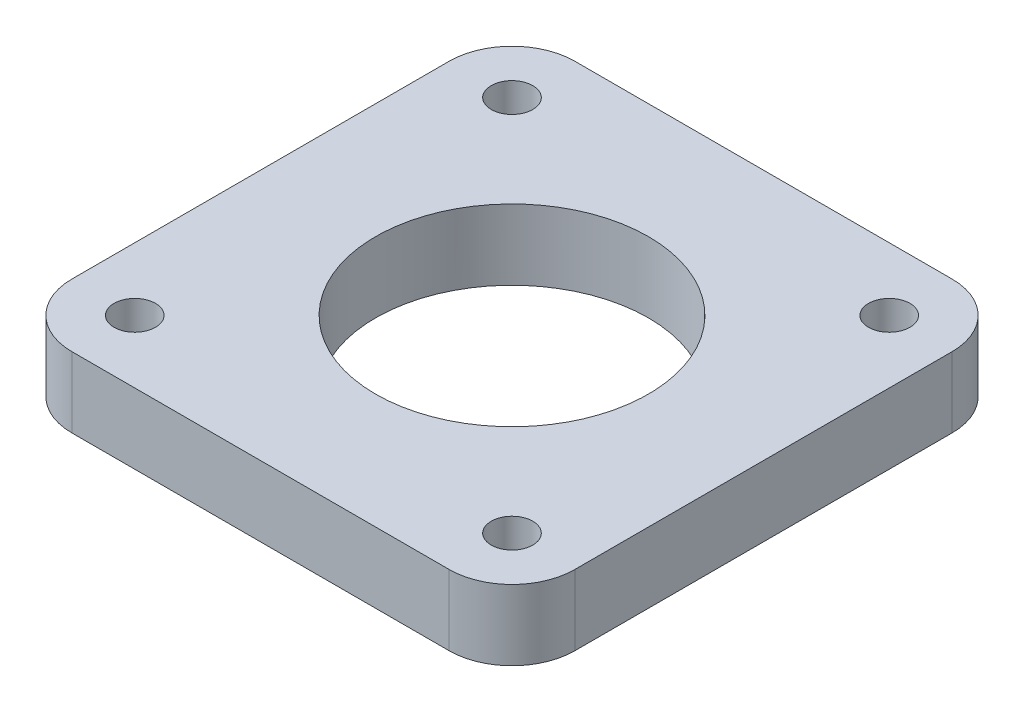
ISO-10303-21;
HEADER;
FILE_DESCRIPTION(('STEP AP214'),'2;1');
FILE_NAME('part.step','',(''),(''),'','','');
FILE_SCHEMA(('AUTOMOTIVE_DESIGN { 1 0 10303 214 1 1 1 1 }'));
ENDSEC;
DATA;
#1=APPLICATION_CONTEXT('core data for automotive mechanical design processes');
#2=APPLICATION_PROTOCOL_DEFINITION('international standard','automotive_design',2000,#1);
#3=PRODUCT_CONTEXT('',#1,'mechanical');
#4=PRODUCT('Part','Part','',(#3));
#5=PRODUCT_RELATED_PRODUCT_CATEGORY('part','',(#4));
#6=PRODUCT_DEFINITION_FORMATION('','',#4);
#7=PRODUCT_DEFINITION_CONTEXT('part definition',#1,'design');
#8=PRODUCT_DEFINITION('design','',#6,#7);
#9=PRODUCT_DEFINITION_SHAPE('','',#8);
#10=(LENGTH_UNIT() NAMED_UNIT(*) SI_UNIT(.MILLI.,.METRE.));
#11=(NAMED_UNIT(*) PLANE_ANGLE_UNIT() SI_UNIT($,.RADIAN.));
#12=(NAMED_UNIT(*) SI_UNIT($,.STERADIAN.) SOLID_ANGLE_UNIT());
#13=UNCERTAINTY_MEASURE_WITH_UNIT(LENGTH_MEASURE(1.E-05),#10,'distance_accuracy_value','');
#14=(GEOMETRIC_REPRESENTATION_CONTEXT(3) GLOBAL_UNCERTAINTY_ASSIGNED_CONTEXT((#13)) GLOBAL_UNIT_ASSIGNED_CONTEXT((#10,
#11,#12)) REPRESENTATION_CONTEXT('',''));
#15=CARTESIAN_POINT('',(0.,0.,0.));
#16=DIRECTION('',(0.,0.,1.));
#17=DIRECTION('',(1.,0.,0.));
#18=AXIS2_PLACEMENT_3D('',#15,#16,#17);
#19=CARTESIAN_POINT('',(15.,5.6,15.));
#20=DIRECTION('',(0.,-1.,0.));
#21=DIRECTION('',(0.,0.,-1.));
#22=AXIS2_PLACEMENT_3D('',#19,#20,#21);
#23=CYLINDRICAL_SURFACE('',#22,5.);
#24=CARTESIAN_POINT('',(15.,0.,15.));
#25=DIRECTION('',(0.,1.,0.));
#26=DIRECTION('',(0.,0.,1.));
#27=AXIS2_PLACEMENT_3D('',#24,#25,#26);
#28=CIRCLE('',#27,5.);
#29=CARTESIAN_POINT('',(15.,0.,20.));
#30=VERTEX_POINT('',#29);
#31=CARTESIAN_POINT('',(20.,0.,15.));
#32=VERTEX_POINT('',#31);
#33=EDGE_CURVE('E144',#30,#32,#28,.T.);
#34=ORIENTED_EDGE('',*,*,#33,.T.);
#35=DIRECTION('',(0.,-1.,0.));
#36=VECTOR('',#35,1.);
#37=CARTESIAN_POINT('',(20.,5.6,15.));
#38=LINE('',#37,#36);
#39=CARTESIAN_POINT('',(20.,5.6,15.));
#40=VERTEX_POINT('',#39);
#41=EDGE_CURVE('E11',#40,#32,#38,.T.);
#42=ORIENTED_EDGE('',*,*,#41,.F.);
#43=CARTESIAN_POINT('',(15.,5.6,15.));
#44=DIRECTION('',(0.,1.,0.));
#45=DIRECTION('',(0.,0.,1.));
#46=AXIS2_PLACEMENT_3D('',#43,#44,#45);
#47=CIRCLE('',#46,5.);
#48=CARTESIAN_POINT('',(15.,5.6,20.));
#49=VERTEX_POINT('',#48);
#50=EDGE_CURVE('E167',#49,#40,#47,.T.);
#51=ORIENTED_EDGE('',*,*,#50,.F.);
#52=DIRECTION('',(0.,-1.,0.));
#53=VECTOR('',#52,1.);
#54=CARTESIAN_POINT('',(15.,5.6,20.));
#55=LINE('',#54,#53);
#56=EDGE_CURVE('E140',#49,#30,#55,.T.);
#57=ORIENTED_EDGE('',*,*,#56,.T.);
#58=EDGE_LOOP('',(#34,#42,#51,#57));
#59=FACE_BOUND('',#58,.T.);
#60=ADVANCED_FACE('F43',(#59),#23,.T.);
#61=CARTESIAN_POINT('',(20.,5.6,-15.));
#62=DIRECTION('',(-1.,0.,0.));
#63=DIRECTION('',(0.,0.,1.));
#64=AXIS2_PLACEMENT_3D('',#61,#62,#63);
#65=PLANE('',#64);
#66=DIRECTION('',(0.,0.,-1.));
#67=VECTOR('',#66,1.);
#68=CARTESIAN_POINT('',(20.,0.,-15.));
#69=LINE('',#68,#67);
#70=CARTESIAN_POINT('',(20.,0.,-15.));
#71=VERTEX_POINT('',#70);
#72=EDGE_CURVE('E148',#32,#71,#69,.T.);
#73=ORIENTED_EDGE('',*,*,#72,.T.);
#74=DIRECTION('',(0.,-1.,0.));
#75=VECTOR('',#74,1.);
#76=CARTESIAN_POINT('',(20.,5.6,-15.));
#77=LINE('',#76,#75);
#78=CARTESIAN_POINT('',(20.,5.6,-15.));
#79=VERTEX_POINT('',#78);
#80=EDGE_CURVE('E52',#79,#71,#77,.T.);
#81=ORIENTED_EDGE('',*,*,#80,.F.);
#82=DIRECTION('',(0.,0.,-1.));
#83=VECTOR('',#82,1.);
#84=CARTESIAN_POINT('',(20.,5.6,-15.));
#85=LINE('',#84,#83);
#86=EDGE_CURVE('E103',#40,#79,#85,.T.);
#87=ORIENTED_EDGE('',*,*,#86,.F.);
#88=ORIENTED_EDGE('',*,*,#41,.T.);
#89=EDGE_LOOP('',(#73,#81,#87,#88));
#90=FACE_BOUND('',#89,.T.);
#91=ADVANCED_FACE('F277',(#90),#65,.F.);
#92=CARTESIAN_POINT('',(15.,5.6,-15.));
#93=DIRECTION('',(0.,-1.,0.));
#94=DIRECTION('',(0.,0.,-1.));
#95=AXIS2_PLACEMENT_3D('',#92,#93,#94);
#96=CYLINDRICAL_SURFACE('',#95,5.);
#97=CARTESIAN_POINT('',(15.,0.,-15.));
#98=DIRECTION('',(0.,1.,0.));
#99=DIRECTION('',(0.,0.,-1.));
#100=AXIS2_PLACEMENT_3D('',#97,#98,#99);
#101=CIRCLE('',#100,5.);
#102=CARTESIAN_POINT('',(15.,0.,-20.));
#103=VERTEX_POINT('',#102);
#104=EDGE_CURVE('E152',#71,#103,#101,.T.);
#105=ORIENTED_EDGE('',*,*,#104,.T.);
#106=DIRECTION('',(0.,-1.,0.));
#107=VECTOR('',#106,1.);
#108=CARTESIAN_POINT('',(15.,5.6,-20.));
#109=LINE('',#108,#107);
#110=CARTESIAN_POINT('',(15.,5.6,-20.));
#111=VERTEX_POINT('',#110);
#112=EDGE_CURVE('E178',#111,#103,#109,.T.);
#113=ORIENTED_EDGE('',*,*,#112,.F.);
#114=CARTESIAN_POINT('',(15.,5.6,-15.));
#115=DIRECTION('',(0.,1.,0.));
#116=DIRECTION('',(0.,0.,-1.));
#117=AXIS2_PLACEMENT_3D('',#114,#115,#116);
#118=CIRCLE('',#117,5.);
#119=EDGE_CURVE('E188',#79,#111,#118,.T.);
#120=ORIENTED_EDGE('',*,*,#119,.F.);
#121=ORIENTED_EDGE('',*,*,#80,.T.);
#122=EDGE_LOOP('',(#105,#113,#120,#121));
#123=FACE_BOUND('',#122,.T.);
#124=ADVANCED_FACE('F186',(#123),#96,.T.);
#125=CARTESIAN_POINT('',(-15.,5.6,-20.));
#126=DIRECTION('',(0.,0.,1.));
#127=DIRECTION('',(1.,0.,0.));
#128=AXIS2_PLACEMENT_3D('',#125,#126,#127);
#129=PLANE('',#128);
#130=DIRECTION('',(-1.,0.,0.));
#131=VECTOR('',#130,1.);
#132=CARTESIAN_POINT('',(-15.,0.,-20.));
#133=LINE('',#132,#131);
#134=CARTESIAN_POINT('',(-15.,0.,-20.));
#135=VERTEX_POINT('',#134);
#136=EDGE_CURVE('E155',#103,#135,#133,.T.);
#137=ORIENTED_EDGE('',*,*,#136,.T.);
#138=DIRECTION('',(0.,-1.,0.));
#139=VECTOR('',#138,1.);
#140=CARTESIAN_POINT('',(-15.,5.6,-20.));
#141=LINE('',#140,#139);
#142=CARTESIAN_POINT('',(-15.,5.6,-20.));
#143=VERTEX_POINT('',#142);
#144=EDGE_CURVE('E174',#143,#135,#141,.T.);
#145=ORIENTED_EDGE('',*,*,#144,.F.);
#146=DIRECTION('',(-1.,0.,0.));
#147=VECTOR('',#146,1.);
#148=CARTESIAN_POINT('',(-15.,5.6,-20.));
#149=LINE('',#148,#147);
#150=EDGE_CURVE('E201',#111,#143,#149,.T.);
#151=ORIENTED_EDGE('',*,*,#150,.F.);
#152=ORIENTED_EDGE('',*,*,#112,.T.);
#153=EDGE_LOOP('',(#137,#145,#151,#152));
#154=FACE_BOUND('',#153,.T.);
#155=ADVANCED_FACE('F196',(#154),#129,.F.);
#156=CARTESIAN_POINT('',(-15.,5.6,-15.));
#157=DIRECTION('',(0.,-1.,0.));
#158=DIRECTION('',(0.,0.,-1.));
#159=AXIS2_PLACEMENT_3D('',#156,#157,#158);
#160=CYLINDRICAL_SURFACE('',#159,5.);
#161=CARTESIAN_POINT('',(-15.,0.,-15.));
#162=DIRECTION('',(0.,1.,0.));
#163=DIRECTION('',(0.,0.,1.));
#164=AXIS2_PLACEMENT_3D('',#161,#162,#163);
#165=CIRCLE('',#164,5.);
#166=CARTESIAN_POINT('',(-20.,0.,-15.));
#167=VERTEX_POINT('',#166);
#168=EDGE_CURVE('E158',#135,#167,#165,.T.);
#169=ORIENTED_EDGE('',*,*,#168,.T.);
#170=DIRECTION('',(0.,-1.,0.));
#171=VECTOR('',#170,1.);
#172=CARTESIAN_POINT('',(-20.,5.6,-15.));
#173=LINE('',#172,#171);
#174=CARTESIAN_POINT('',(-20.,5.6,-15.));
#175=VERTEX_POINT('',#174);
#176=EDGE_CURVE('E133',#175,#167,#173,.T.);
#177=ORIENTED_EDGE('',*,*,#176,.F.);
#178=CARTESIAN_POINT('',(-15.,5.6,-15.));
#179=DIRECTION('',(0.,1.,0.));
#180=DIRECTION('',(0.,0.,1.));
#181=AXIS2_PLACEMENT_3D('',#178,#179,#180);
#182=CIRCLE('',#181,5.);
#183=EDGE_CURVE('E122',#143,#175,#182,.T.);
#184=ORIENTED_EDGE('',*,*,#183,.F.);
#185=ORIENTED_EDGE('',*,*,#144,.T.);
#186=EDGE_LOOP('',(#169,#177,#184,#185));
#187=FACE_BOUND('',#186,.T.);
#188=ADVANCED_FACE('F199',(#187),#160,.T.);
#189=CARTESIAN_POINT('',(-20.,5.6,-15.));
#190=DIRECTION('',(1.,0.,0.));
#191=DIRECTION('',(0.,0.,-1.));
#192=AXIS2_PLACEMENT_3D('',#189,#190,#191);
#193=PLANE('',#192);
#194=DIRECTION('',(0.,0.,1.));
#195=VECTOR('',#194,1.);
#196=CARTESIAN_POINT('',(-20.,0.,-15.));
#197=LINE('',#196,#195);
#198=CARTESIAN_POINT('',(-20.,0.,15.));
#199=VERTEX_POINT('',#198);
#200=EDGE_CURVE('E131',#167,#199,#197,.T.);
#201=ORIENTED_EDGE('',*,*,#200,.T.);
#202=DIRECTION('',(0.,-1.,0.));
#203=VECTOR('',#202,1.);
#204=CARTESIAN_POINT('',(-20.,5.6,15.));
#205=LINE('',#204,#203);
#206=CARTESIAN_POINT('',(-20.,5.6,15.));
#207=VERTEX_POINT('',#206);
#208=EDGE_CURVE('E128',#207,#199,#205,.T.);
#209=ORIENTED_EDGE('',*,*,#208,.F.);
#210=DIRECTION('',(0.,0.,1.));
#211=VECTOR('',#210,1.);
#212=CARTESIAN_POINT('',(-20.,5.6,-15.));
#213=LINE('',#212,#211);
#214=EDGE_CURVE('E116',#175,#207,#213,.T.);
#215=ORIENTED_EDGE('',*,*,#214,.F.);
#216=ORIENTED_EDGE('',*,*,#176,.T.);
#217=EDGE_LOOP('',(#201,#209,#215,#216));
#218=FACE_BOUND('',#217,.T.);
#219=ADVANCED_FACE('F129',(#218),#193,.F.);
#220=CARTESIAN_POINT('',(-15.,5.6,15.));
#221=DIRECTION('',(0.,-1.,0.));
#222=DIRECTION('',(0.,0.,-1.));
#223=AXIS2_PLACEMENT_3D('',#220,#221,#222);
#224=CYLINDRICAL_SURFACE('',#223,5.);
#225=CARTESIAN_POINT('',(-15.,0.,15.));
#226=DIRECTION('',(0.,1.,0.));
#227=DIRECTION('',(0.,0.,1.));
#228=AXIS2_PLACEMENT_3D('',#225,#226,#227);
#229=CIRCLE('',#228,5.);
#230=CARTESIAN_POINT('',(-15.,0.,20.));
#231=VERTEX_POINT('',#230);
#232=EDGE_CURVE('E89',#199,#231,#229,.T.);
#233=ORIENTED_EDGE('',*,*,#232,.T.);
#234=DIRECTION('',(0.,-1.,0.));
#235=VECTOR('',#234,1.);
#236=CARTESIAN_POINT('',(-15.,5.6,20.));
#237=LINE('',#236,#235);
#238=CARTESIAN_POINT('',(-15.,5.6,20.));
#239=VERTEX_POINT('',#238);
#240=EDGE_CURVE('E134',#239,#231,#237,.T.);
#241=ORIENTED_EDGE('',*,*,#240,.F.);
#242=CARTESIAN_POINT('',(-15.,5.6,15.));
#243=DIRECTION('',(0.,1.,0.));
#244=DIRECTION('',(0.,0.,1.));
#245=AXIS2_PLACEMENT_3D('',#242,#243,#244);
#246=CIRCLE('',#245,5.);
#247=EDGE_CURVE('E120',#207,#239,#246,.T.);
#248=ORIENTED_EDGE('',*,*,#247,.F.);
#249=ORIENTED_EDGE('',*,*,#208,.T.);
#250=EDGE_LOOP('',(#233,#241,#248,#249));
#251=FACE_BOUND('',#250,.T.);
#252=ADVANCED_FACE('F136',(#251),#224,.T.);
#253=CARTESIAN_POINT('',(-15.,5.6,20.));
#254=DIRECTION('',(0.,0.,-1.));
#255=DIRECTION('',(-1.,0.,0.));
#256=AXIS2_PLACEMENT_3D('',#253,#254,#255);
#257=PLANE('',#256);
#258=DIRECTION('',(1.,0.,0.));
#259=VECTOR('',#258,1.);
#260=CARTESIAN_POINT('',(-15.,0.,20.));
#261=LINE('',#260,#259);
#262=EDGE_CURVE('E95',#231,#30,#261,.T.);
#263=ORIENTED_EDGE('',*,*,#262,.T.);
#264=ORIENTED_EDGE('',*,*,#56,.F.);
#265=DIRECTION('',(1.,0.,0.));
#266=VECTOR('',#265,1.);
#267=CARTESIAN_POINT('',(-15.,5.6,20.));
#268=LINE('',#267,#266);
#269=EDGE_CURVE('E60',#239,#49,#268,.T.);
#270=ORIENTED_EDGE('',*,*,#269,.F.);
#271=ORIENTED_EDGE('',*,*,#240,.T.);
#272=EDGE_LOOP('',(#263,#264,#270,#271));
#273=FACE_BOUND('',#272,.T.);
#274=ADVANCED_FACE('F255',(#273),#257,.F.);
#275=CARTESIAN_POINT('',(15.,5.6,15.));
#276=DIRECTION('',(0.,1.,0.));
#277=DIRECTION('',(0.,0.,1.));
#278=AXIS2_PLACEMENT_3D('',#275,#276,#277);
#279=PLANE('',#278);
#280=CARTESIAN_POINT('',(-15.,5.6,15.));
#281=DIRECTION('',(0.,1.,0.));
#282=DIRECTION('',(0.,0.,-1.));
#283=AXIS2_PLACEMENT_3D('',#280,#281,#282);
#284=CIRCLE('',#283,1.65);
#285=CARTESIAN_POINT('',(-15.,5.6,13.35));
#286=VERTEX_POINT('',#285);
#287=EDGE_CURVE('E231',#286,#286,#284,.T.);
#288=ORIENTED_EDGE('',*,*,#287,.F.);
#289=EDGE_LOOP('',(#288));
#290=FACE_BOUND('',#289,.T.);
#291=CARTESIAN_POINT('',(15.,5.6,15.));
#292=DIRECTION('',(0.,1.,0.));
#293=DIRECTION('',(0.,0.,1.));
#294=AXIS2_PLACEMENT_3D('',#291,#292,#293);
#295=CIRCLE('',#294,1.65);
#296=CARTESIAN_POINT('',(15.,5.6,16.65));
#297=VERTEX_POINT('',#296);
#298=EDGE_CURVE('E239',#297,#297,#295,.T.);
#299=ORIENTED_EDGE('',*,*,#298,.F.);
#300=EDGE_LOOP('',(#299));
#301=FACE_BOUND('',#300,.T.);
#302=CARTESIAN_POINT('',(15.,5.6,-15.));
#303=DIRECTION('',(0.,1.,0.));
#304=DIRECTION('',(0.,0.,-1.));
#305=AXIS2_PLACEMENT_3D('',#302,#303,#304);
#306=CIRCLE('',#305,1.65);
#307=CARTESIAN_POINT('',(15.,5.6,-16.65));
#308=VERTEX_POINT('',#307);
#309=EDGE_CURVE('E223',#308,#308,#306,.T.);
#310=ORIENTED_EDGE('',*,*,#309,.F.);
#311=EDGE_LOOP('',(#310));
#312=FACE_BOUND('',#311,.T.);
#313=CARTESIAN_POINT('',(-15.,5.6,-15.));
#314=DIRECTION('',(0.,1.,0.));
#315=DIRECTION('',(0.,0.,1.));
#316=AXIS2_PLACEMENT_3D('',#313,#314,#315);
#317=CIRCLE('',#316,1.65);
#318=CARTESIAN_POINT('',(-15.,5.6,-13.35));
#319=VERTEX_POINT('',#318);
#320=EDGE_CURVE('E219',#319,#319,#317,.T.);
#321=ORIENTED_EDGE('',*,*,#320,.F.);
#322=EDGE_LOOP('',(#321));
#323=FACE_BOUND('',#322,.T.);
#324=CARTESIAN_POINT('',(0.,5.6,0.));
#325=DIRECTION('',(0.,1.,0.));
#326=DIRECTION('',(0.,0.,1.));
#327=AXIS2_PLACEMENT_3D('',#324,#325,#326);
#328=CIRCLE('',#327,10.85);
#329=CARTESIAN_POINT('',(0.,5.6,10.85));
#330=VERTEX_POINT('',#329);
#331=EDGE_CURVE('E149',#330,#330,#328,.T.);
#332=ORIENTED_EDGE('',*,*,#331,.F.);
#333=EDGE_LOOP('',(#332));
#334=FACE_BOUND('',#333,.T.);
#335=ORIENTED_EDGE('',*,*,#50,.T.);
#336=ORIENTED_EDGE('',*,*,#86,.T.);
#337=ORIENTED_EDGE('',*,*,#119,.T.);
#338=ORIENTED_EDGE('',*,*,#150,.T.);
#339=ORIENTED_EDGE('',*,*,#183,.T.);
#340=ORIENTED_EDGE('',*,*,#214,.T.);
#341=ORIENTED_EDGE('',*,*,#247,.T.);
#342=ORIENTED_EDGE('',*,*,#269,.T.);
#343=EDGE_LOOP('',(#335,#336,#337,#338,#339,#340,#341,#342));
#344=FACE_BOUND('',#343,.T.);
#345=ADVANCED_FACE('F118',(#290,#301,#312,#323,#334,#344),#279,.T.);
#346=CARTESIAN_POINT('',(15.,0.,15.));
#347=DIRECTION('',(0.,1.,0.));
#348=DIRECTION('',(0.,0.,1.));
#349=AXIS2_PLACEMENT_3D('',#346,#347,#348);
#350=PLANE('',#349);
#351=CARTESIAN_POINT('',(-15.,0.,15.));
#352=DIRECTION('',(0.,1.,0.));
#353=DIRECTION('',(0.,0.,-1.));
#354=AXIS2_PLACEMENT_3D('',#351,#352,#353);
#355=CIRCLE('',#354,1.65);
#356=CARTESIAN_POINT('',(-15.,0.,13.35));
#357=VERTEX_POINT('',#356);
#358=EDGE_CURVE('E227',#357,#357,#355,.T.);
#359=ORIENTED_EDGE('',*,*,#358,.T.);
#360=EDGE_LOOP('',(#359));
#361=FACE_BOUND('',#360,.T.);
#362=CARTESIAN_POINT('',(15.,0.,15.));
#363=DIRECTION('',(0.,1.,0.));
#364=DIRECTION('',(0.,0.,1.));
#365=AXIS2_PLACEMENT_3D('',#362,#363,#364);
#366=CIRCLE('',#365,1.65);
#367=CARTESIAN_POINT('',(15.,0.,16.65));
#368=VERTEX_POINT('',#367);
#369=EDGE_CURVE('E235',#368,#368,#366,.T.);
#370=ORIENTED_EDGE('',*,*,#369,.T.);
#371=EDGE_LOOP('',(#370));
#372=FACE_BOUND('',#371,.T.);
#373=CARTESIAN_POINT('',(15.,0.,-15.));
#374=DIRECTION('',(0.,1.,0.));
#375=DIRECTION('',(0.,0.,-1.));
#376=AXIS2_PLACEMENT_3D('',#373,#374,#375);
#377=CIRCLE('',#376,1.65);
#378=CARTESIAN_POINT('',(15.,0.,-16.65));
#379=VERTEX_POINT('',#378);
#380=EDGE_CURVE('E243',#379,#379,#377,.T.);
#381=ORIENTED_EDGE('',*,*,#380,.T.);
#382=EDGE_LOOP('',(#381));
#383=FACE_BOUND('',#382,.T.);
#384=CARTESIAN_POINT('',(-15.,0.,-15.));
#385=DIRECTION('',(0.,1.,0.));
#386=DIRECTION('',(0.,0.,1.));
#387=AXIS2_PLACEMENT_3D('',#384,#385,#386);
#388=CIRCLE('',#387,1.65);
#389=CARTESIAN_POINT('',(-15.,0.,-13.35));
#390=VERTEX_POINT('',#389);
#391=EDGE_CURVE('E218',#390,#390,#388,.T.);
#392=ORIENTED_EDGE('',*,*,#391,.T.);
#393=EDGE_LOOP('',(#392));
#394=FACE_BOUND('',#393,.T.);
#395=CARTESIAN_POINT('',(0.,0.,0.));
#396=DIRECTION('',(0.,-1.,0.));
#397=DIRECTION('',(0.,0.,-1.));
#398=AXIS2_PLACEMENT_3D('',#395,#396,#397);
#399=CIRCLE('',#398,10.85);
#400=CARTESIAN_POINT('',(0.,0.,-10.85));
#401=VERTEX_POINT('',#400);
#402=EDGE_CURVE('E214',#401,#401,#399,.T.);
#403=ORIENTED_EDGE('',*,*,#402,.F.);
#404=EDGE_LOOP('',(#403));
#405=FACE_BOUND('',#404,.T.);
#406=ORIENTED_EDGE('',*,*,#33,.F.);
#407=ORIENTED_EDGE('',*,*,#262,.F.);
#408=ORIENTED_EDGE('',*,*,#232,.F.);
#409=ORIENTED_EDGE('',*,*,#200,.F.);
#410=ORIENTED_EDGE('',*,*,#168,.F.);
#411=ORIENTED_EDGE('',*,*,#136,.F.);
#412=ORIENTED_EDGE('',*,*,#104,.F.);
#413=ORIENTED_EDGE('',*,*,#72,.F.);
#414=EDGE_LOOP('',(#406,#407,#408,#409,#410,#411,#412,#413));
#415=FACE_BOUND('',#414,.T.);
#416=ADVANCED_FACE('F192',(#361,#372,#383,#394,#405,#415),#350,.F.);
#417=CARTESIAN_POINT('',(0.,7.5,0.));
#418=DIRECTION('',(0.,-1.,0.));
#419=DIRECTION('',(0.,0.,-1.));
#420=AXIS2_PLACEMENT_3D('',#417,#418,#419);
#421=CYLINDRICAL_SURFACE('',#420,10.85);
#422=ORIENTED_EDGE('',*,*,#331,.T.);
#423=EDGE_LOOP('',(#422));
#424=FACE_BOUND('',#423,.T.);
#425=ORIENTED_EDGE('',*,*,#402,.T.);
#426=EDGE_LOOP('',(#425));
#427=FACE_BOUND('',#426,.T.);
#428=ADVANCED_FACE('F262',(#424,#427),#421,.F.);
#429=CARTESIAN_POINT('',(-15.,0.,-15.));
#430=DIRECTION('',(0.,1.,0.));
#431=DIRECTION('',(0.,0.,1.));
#432=AXIS2_PLACEMENT_3D('',#429,#430,#431);
#433=CYLINDRICAL_SURFACE('',#432,1.65);
#434=ORIENTED_EDGE('',*,*,#391,.F.);
#435=EDGE_LOOP('',(#434));
#436=FACE_BOUND('',#435,.T.);
#437=ORIENTED_EDGE('',*,*,#320,.T.);
#438=EDGE_LOOP('',(#437));
#439=FACE_BOUND('',#438,.T.);
#440=ADVANCED_FACE('F265',(#436,#439),#433,.F.);
#441=CARTESIAN_POINT('',(15.,0.,-15.));
#442=DIRECTION('',(0.,1.,0.));
#443=DIRECTION('',(0.,0.,1.));
#444=AXIS2_PLACEMENT_3D('',#441,#442,#443);
#445=CYLINDRICAL_SURFACE('',#444,1.65);
#446=ORIENTED_EDGE('',*,*,#380,.F.);
#447=EDGE_LOOP('',(#446));
#448=FACE_BOUND('',#447,.T.);
#449=ORIENTED_EDGE('',*,*,#309,.T.);
#450=EDGE_LOOP('',(#449));
#451=FACE_BOUND('',#450,.T.);
#452=ADVANCED_FACE('F251',(#448,#451),#445,.F.);
#453=CARTESIAN_POINT('',(15.,0.,15.));
#454=DIRECTION('',(0.,1.,0.));
#455=DIRECTION('',(0.,0.,1.));
#456=AXIS2_PLACEMENT_3D('',#453,#454,#455);
#457=CYLINDRICAL_SURFACE('',#456,1.65);
#458=ORIENTED_EDGE('',*,*,#369,.F.);
#459=EDGE_LOOP('',(#458));
#460=FACE_BOUND('',#459,.T.);
#461=ORIENTED_EDGE('',*,*,#298,.T.);
#462=EDGE_LOOP('',(#461));
#463=FACE_BOUND('',#462,.T.);
#464=ADVANCED_FACE('F361',(#460,#463),#457,.F.);
#465=CARTESIAN_POINT('',(-15.,0.,15.));
#466=DIRECTION('',(0.,1.,0.));
#467=DIRECTION('',(0.,0.,1.));
#468=AXIS2_PLACEMENT_3D('',#465,#466,#467);
#469=CYLINDRICAL_SURFACE('',#468,1.65);
#470=ORIENTED_EDGE('',*,*,#358,.F.);
#471=EDGE_LOOP('',(#470));
#472=FACE_BOUND('',#471,.T.);
#473=ORIENTED_EDGE('',*,*,#287,.T.);
#474=EDGE_LOOP('',(#473));
#475=FACE_BOUND('',#474,.T.);
#476=ADVANCED_FACE('F372',(#472,#475),#469,.F.);
#477=CLOSED_SHELL('',(#60,#91,#124,#155,#188,#219,#252,#274,#345,#416,#428,#440,#452,#464,#476));
#478=MANIFOLD_SOLID_BREP('B2',#477);
#479=ADVANCED_BREP_SHAPE_REPRESENTATION('',(#18,#478),#14);
#480=SHAPE_DEFINITION_REPRESENTATION(#9,#479);
ENDSEC;
END-ISO-10303-21;
